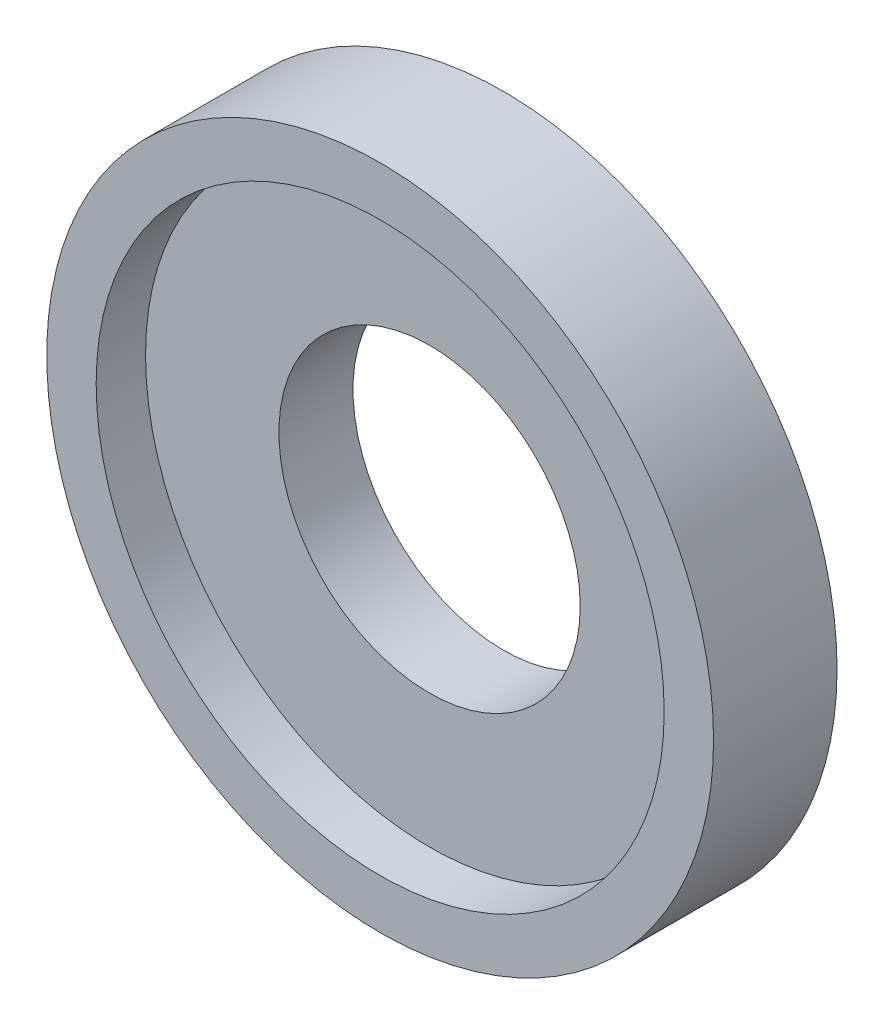
ISO-10303-21;
HEADER;
FILE_DESCRIPTION(('STEP AP214'),'2;1');
FILE_NAME('part.step','',(''),(''),'','','');
FILE_SCHEMA(('AUTOMOTIVE_DESIGN { 1 0 10303 214 1 1 1 1 }'));
ENDSEC;
DATA;
#1=APPLICATION_CONTEXT('core data for automotive mechanical design processes');
#2=APPLICATION_PROTOCOL_DEFINITION('international standard','automotive_design',2000,#1);
#3=PRODUCT_CONTEXT('',#1,'mechanical');
#4=PRODUCT('Part','Part','',(#3));
#5=PRODUCT_RELATED_PRODUCT_CATEGORY('part','',(#4));
#6=PRODUCT_DEFINITION_FORMATION('','',#4);
#7=PRODUCT_DEFINITION_CONTEXT('part definition',#1,'design');
#8=PRODUCT_DEFINITION('design','',#6,#7);
#9=PRODUCT_DEFINITION_SHAPE('','',#8);
#10=(LENGTH_UNIT() NAMED_UNIT(*) SI_UNIT(.MILLI.,.METRE.));
#11=(NAMED_UNIT(*) PLANE_ANGLE_UNIT() SI_UNIT($,.RADIAN.));
#12=(NAMED_UNIT(*) SI_UNIT($,.STERADIAN.) SOLID_ANGLE_UNIT());
#13=UNCERTAINTY_MEASURE_WITH_UNIT(LENGTH_MEASURE(1.E-05),#10,'distance_accuracy_value','');
#14=(GEOMETRIC_REPRESENTATION_CONTEXT(3) GLOBAL_UNCERTAINTY_ASSIGNED_CONTEXT((#13)) GLOBAL_UNIT_ASSIGNED_CONTEXT((#10,
#11,#12)) REPRESENTATION_CONTEXT('',''));
#15=CARTESIAN_POINT('',(0.,0.,0.));
#16=DIRECTION('',(0.,0.,1.));
#17=DIRECTION('',(1.,0.,0.));
#18=AXIS2_PLACEMENT_3D('',#15,#16,#17);
#19=CARTESIAN_POINT('',(0.,0.,0.));
#20=DIRECTION('',(0.,0.,1.));
#21=DIRECTION('',(1.,0.,0.));
#22=AXIS2_PLACEMENT_3D('',#19,#20,#21);
#23=CYLINDRICAL_SURFACE('',#22,3.05);
#24=CARTESIAN_POINT('',(0.,0.,0.));
#25=DIRECTION('',(0.,0.,1.));
#26=DIRECTION('',(1.,0.,0.));
#27=AXIS2_PLACEMENT_3D('',#24,#25,#26);
#28=CIRCLE('',#27,3.05);
#29=CARTESIAN_POINT('',(3.05,0.,0.));
#30=VERTEX_POINT('',#29);
#31=EDGE_CURVE('E52',#30,#30,#28,.T.);
#32=ORIENTED_EDGE('',*,*,#31,.F.);
#33=EDGE_LOOP('',(#32));
#34=FACE_BOUND('',#33,.T.);
#35=CARTESIAN_POINT('',(0.,0.,1.5));
#36=DIRECTION('',(0.,0.,1.));
#37=DIRECTION('',(1.,0.,0.));
#38=AXIS2_PLACEMENT_3D('',#35,#36,#37);
#39=CIRCLE('',#38,3.05);
#40=CARTESIAN_POINT('',(3.05,0.,1.5));
#41=VERTEX_POINT('',#40);
#42=EDGE_CURVE('E41',#41,#41,#39,.F.);
#43=ORIENTED_EDGE('',*,*,#42,.F.);
#44=EDGE_LOOP('',(#43));
#45=FACE_BOUND('',#44,.T.);
#46=ADVANCED_FACE('F37',(#34,#45),#23,.F.);
#47=CARTESIAN_POINT('',(0.,0.,2.5));
#48=DIRECTION('',(0.,0.,-1.));
#49=DIRECTION('',(-1.,0.,0.));
#50=AXIS2_PLACEMENT_3D('',#47,#48,#49);
#51=CYLINDRICAL_SURFACE('',#50,6.75);
#52=CARTESIAN_POINT('',(0.,0.,2.5));
#53=DIRECTION('',(0.,0.,1.));
#54=DIRECTION('',(1.,0.,0.));
#55=AXIS2_PLACEMENT_3D('',#52,#53,#54);
#56=CIRCLE('',#55,6.75);
#57=CARTESIAN_POINT('',(6.75,0.,2.5));
#58=VERTEX_POINT('',#57);
#59=EDGE_CURVE('E10',#58,#58,#56,.T.);
#60=ORIENTED_EDGE('',*,*,#59,.F.);
#61=EDGE_LOOP('',(#60));
#62=FACE_BOUND('',#61,.T.);
#63=CARTESIAN_POINT('',(0.,0.,0.));
#64=DIRECTION('',(0.,0.,1.));
#65=DIRECTION('',(1.,0.,0.));
#66=AXIS2_PLACEMENT_3D('',#63,#64,#65);
#67=CIRCLE('',#66,6.75);
#68=CARTESIAN_POINT('',(6.75,0.,0.));
#69=VERTEX_POINT('',#68);
#70=EDGE_CURVE('E46',#69,#69,#67,.T.);
#71=ORIENTED_EDGE('',*,*,#70,.T.);
#72=EDGE_LOOP('',(#71));
#73=FACE_BOUND('',#72,.T.);
#74=ADVANCED_FACE('F39',(#62,#73),#51,.T.);
#75=CARTESIAN_POINT('',(0.,0.,2.5));
#76=DIRECTION('',(0.,0.,1.));
#77=DIRECTION('',(1.,0.,0.));
#78=AXIS2_PLACEMENT_3D('',#75,#76,#77);
#79=PLANE('',#78);
#80=CARTESIAN_POINT('',(0.,0.,2.5));
#81=DIRECTION('',(0.,0.,1.));
#82=DIRECTION('',(1.,0.,0.));
#83=AXIS2_PLACEMENT_3D('',#80,#81,#82);
#84=CIRCLE('',#83,5.75);
#85=CARTESIAN_POINT('',(5.75,0.,2.5));
#86=VERTEX_POINT('',#85);
#87=EDGE_CURVE('E57',#86,#86,#84,.T.);
#88=ORIENTED_EDGE('',*,*,#87,.F.);
#89=EDGE_LOOP('',(#88));
#90=FACE_BOUND('',#89,.T.);
#91=ORIENTED_EDGE('',*,*,#59,.T.);
#92=EDGE_LOOP('',(#91));
#93=FACE_BOUND('',#92,.T.);
#94=ADVANCED_FACE('F78',(#90,#93),#79,.T.);
#95=CARTESIAN_POINT('',(0.,0.,0.));
#96=DIRECTION('',(0.,0.,1.));
#97=DIRECTION('',(1.,0.,0.));
#98=AXIS2_PLACEMENT_3D('',#95,#96,#97);
#99=PLANE('',#98);
#100=ORIENTED_EDGE('',*,*,#31,.T.);
#101=EDGE_LOOP('',(#100));
#102=FACE_BOUND('',#101,.T.);
#103=ORIENTED_EDGE('',*,*,#70,.F.);
#104=EDGE_LOOP('',(#103));
#105=FACE_BOUND('',#104,.T.);
#106=ADVANCED_FACE('F86',(#102,#105),#99,.F.);
#107=CARTESIAN_POINT('',(0.,0.,1.5));
#108=DIRECTION('',(0.,0.,1.));
#109=DIRECTION('',(1.,0.,0.));
#110=AXIS2_PLACEMENT_3D('',#107,#108,#109);
#111=PLANE('',#110);
#112=CARTESIAN_POINT('',(0.,0.,1.5));
#113=DIRECTION('',(0.,0.,1.));
#114=DIRECTION('',(1.,0.,0.));
#115=AXIS2_PLACEMENT_3D('',#112,#113,#114);
#116=CIRCLE('',#115,5.75);
#117=CARTESIAN_POINT('',(5.75,0.,1.5));
#118=VERTEX_POINT('',#117);
#119=EDGE_CURVE('E61',#118,#118,#116,.T.);
#120=ORIENTED_EDGE('',*,*,#119,.T.);
#121=EDGE_LOOP('',(#120));
#122=FACE_BOUND('',#121,.T.);
#123=ORIENTED_EDGE('',*,*,#42,.T.);
#124=EDGE_LOOP('',(#123));
#125=FACE_BOUND('',#124,.T.);
#126=ADVANCED_FACE('F70',(#122,#125),#111,.T.);
#127=CARTESIAN_POINT('',(0.,0.,1.5));
#128=DIRECTION('',(0.,0.,1.));
#129=DIRECTION('',(1.,0.,0.));
#130=AXIS2_PLACEMENT_3D('',#127,#128,#129);
#131=CYLINDRICAL_SURFACE('',#130,5.75);
#132=ORIENTED_EDGE('',*,*,#119,.F.);
#133=EDGE_LOOP('',(#132));
#134=FACE_BOUND('',#133,.T.);
#135=ORIENTED_EDGE('',*,*,#87,.T.);
#136=EDGE_LOOP('',(#135));
#137=FACE_BOUND('',#136,.T.);
#138=ADVANCED_FACE('F83',(#134,#137),#131,.F.);
#139=CLOSED_SHELL('',(#46,#74,#94,#106,#126,#138));
#140=MANIFOLD_SOLID_BREP('B2',#139);
#141=ADVANCED_BREP_SHAPE_REPRESENTATION('',(#18,#140),#14);
#142=SHAPE_DEFINITION_REPRESENTATION(#9,#141);
ENDSEC;
END-ISO-10303-21;
